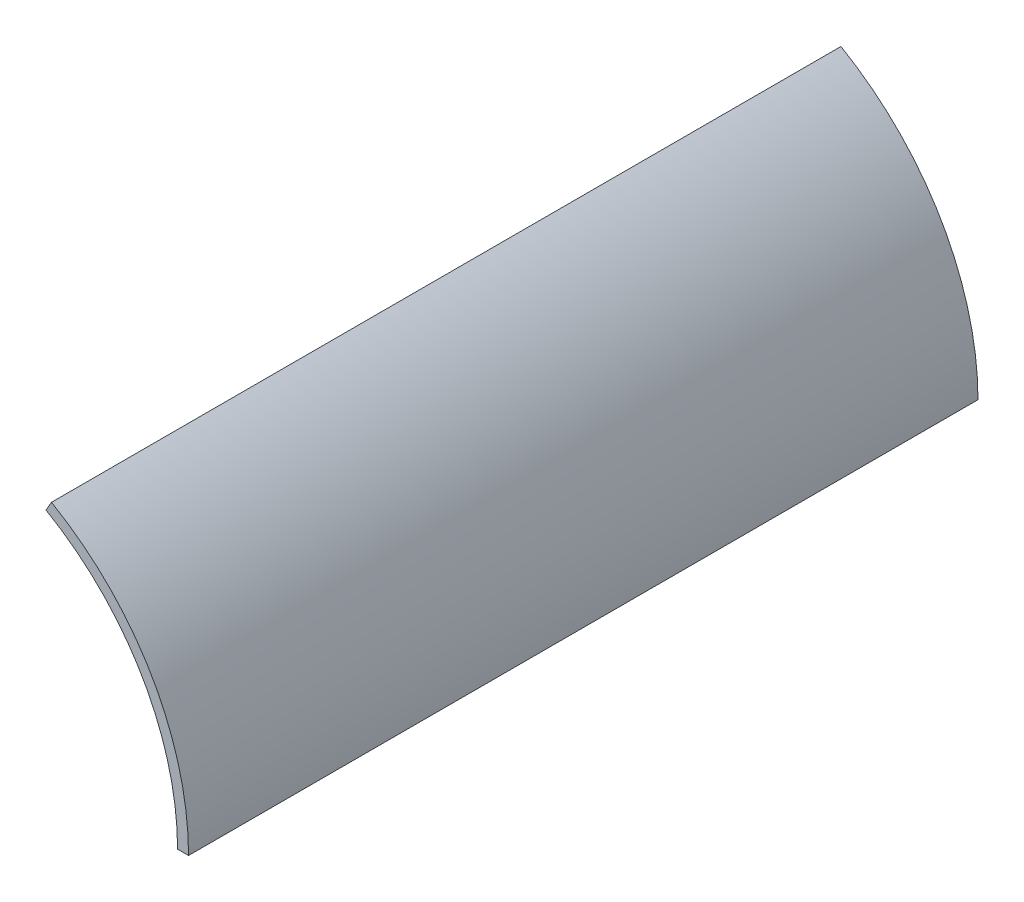
ISO-10303-21;
HEADER;
FILE_DESCRIPTION(('STEP AP214'),'2;1');
FILE_NAME('part.step','',(''),(''),'','','');
FILE_SCHEMA(('AUTOMOTIVE_DESIGN { 1 0 10303 214 1 1 1 1 }'));
ENDSEC;
DATA;
#1=APPLICATION_CONTEXT('core data for automotive mechanical design processes');
#2=APPLICATION_PROTOCOL_DEFINITION('international standard','automotive_design',2000,#1);
#3=PRODUCT_CONTEXT('',#1,'mechanical');
#4=PRODUCT('Part','Part','',(#3));
#5=PRODUCT_RELATED_PRODUCT_CATEGORY('part','',(#4));
#6=PRODUCT_DEFINITION_FORMATION('','',#4);
#7=PRODUCT_DEFINITION_CONTEXT('part definition',#1,'design');
#8=PRODUCT_DEFINITION('design','',#6,#7);
#9=PRODUCT_DEFINITION_SHAPE('','',#8);
#10=(LENGTH_UNIT() NAMED_UNIT(*) SI_UNIT(.MILLI.,.METRE.));
#11=(NAMED_UNIT(*) PLANE_ANGLE_UNIT() SI_UNIT($,.RADIAN.));
#12=(NAMED_UNIT(*) SI_UNIT($,.STERADIAN.) SOLID_ANGLE_UNIT());
#13=UNCERTAINTY_MEASURE_WITH_UNIT(LENGTH_MEASURE(1.E-05),#10,'distance_accuracy_value','');
#14=(GEOMETRIC_REPRESENTATION_CONTEXT(3) GLOBAL_UNCERTAINTY_ASSIGNED_CONTEXT((#13)) GLOBAL_UNIT_ASSIGNED_CONTEXT((#10,
#11,#12)) REPRESENTATION_CONTEXT('',''));
#15=CARTESIAN_POINT('',(0.,0.,0.));
#16=DIRECTION('',(0.,0.,1.));
#17=DIRECTION('',(1.,0.,0.));
#18=AXIS2_PLACEMENT_3D('',#15,#16,#17);
#19=CARTESIAN_POINT('',(0.,0.,120.));
#20=DIRECTION('',(0.,0.,-1.));
#21=DIRECTION('',(-1.,0.,0.));
#22=AXIS2_PLACEMENT_3D('',#19,#20,#21);
#23=CYLINDRICAL_SURFACE('',#22,60.);
#24=CARTESIAN_POINT('',(0.,0.,0.));
#25=DIRECTION('',(0.,0.,-1.));
#26=DIRECTION('',(1.,0.,0.));
#27=AXIS2_PLACEMENT_3D('',#24,#25,#26);
#28=CIRCLE('',#27,60.);
#29=CARTESIAN_POINT('',(29.9999999999999,51.9615242270664,0.));
#30=VERTEX_POINT('',#29);
#31=CARTESIAN_POINT('',(60.,0.,0.));
#32=VERTEX_POINT('',#31);
#33=EDGE_CURVE('E80',#30,#32,#28,.T.);
#34=ORIENTED_EDGE('',*,*,#33,.T.);
#35=DIRECTION('',(0.,0.,-1.));
#36=VECTOR('',#35,1.);
#37=CARTESIAN_POINT('',(60.,0.,120.));
#38=LINE('',#37,#36);
#39=CARTESIAN_POINT('',(60.,0.,180.));
#40=VERTEX_POINT('',#39);
#41=EDGE_CURVE('E11',#40,#32,#38,.T.);
#42=ORIENTED_EDGE('',*,*,#41,.F.);
#43=CARTESIAN_POINT('',(0.,0.,180.));
#44=DIRECTION('',(0.,0.,-1.));
#45=DIRECTION('',(1.,0.,0.));
#46=AXIS2_PLACEMENT_3D('',#43,#44,#45);
#47=CIRCLE('',#46,60.);
#48=CARTESIAN_POINT('',(29.9999999999999,51.9615242270664,180.));
#49=VERTEX_POINT('',#48);
#50=EDGE_CURVE('E78',#49,#40,#47,.T.);
#51=ORIENTED_EDGE('',*,*,#50,.F.);
#52=DIRECTION('',(0.,0.,-1.));
#53=VECTOR('',#52,1.);
#54=CARTESIAN_POINT('',(29.9999999999999,51.9615242270664,120.));
#55=LINE('',#54,#53);
#56=EDGE_CURVE('E103',#49,#30,#55,.T.);
#57=ORIENTED_EDGE('',*,*,#56,.T.);
#58=EDGE_LOOP('',(#34,#42,#51,#57));
#59=FACE_BOUND('',#58,.T.);
#60=ADVANCED_FACE('F35',(#59),#23,.F.);
#61=CARTESIAN_POINT('',(60.,0.,120.));
#62=DIRECTION('',(0.,1.,0.));
#63=DIRECTION('',(0.,0.,1.));
#64=AXIS2_PLACEMENT_3D('',#61,#62,#63);
#65=PLANE('',#64);
#66=DIRECTION('',(1.,0.,0.));
#67=VECTOR('',#66,1.);
#68=CARTESIAN_POINT('',(60.,0.,0.));
#69=LINE('',#68,#67);
#70=CARTESIAN_POINT('',(62.5,0.,0.));
#71=VERTEX_POINT('',#70);
#72=EDGE_CURVE('E99',#32,#71,#69,.T.);
#73=ORIENTED_EDGE('',*,*,#72,.T.);
#74=DIRECTION('',(0.,0.,-1.));
#75=VECTOR('',#74,1.);
#76=CARTESIAN_POINT('',(62.5,0.,120.));
#77=LINE('',#76,#75);
#78=CARTESIAN_POINT('',(62.5,0.,180.));
#79=VERTEX_POINT('',#78);
#80=EDGE_CURVE('E42',#79,#71,#77,.T.);
#81=ORIENTED_EDGE('',*,*,#80,.F.);
#82=DIRECTION('',(1.,0.,0.));
#83=VECTOR('',#82,1.);
#84=CARTESIAN_POINT('',(60.,0.,180.));
#85=LINE('',#84,#83);
#86=EDGE_CURVE('E83',#40,#79,#85,.T.);
#87=ORIENTED_EDGE('',*,*,#86,.F.);
#88=ORIENTED_EDGE('',*,*,#41,.T.);
#89=EDGE_LOOP('',(#73,#81,#87,#88));
#90=FACE_BOUND('',#89,.T.);
#91=ADVANCED_FACE('F84',(#90),#65,.F.);
#92=CARTESIAN_POINT('',(0.,0.,120.));
#93=DIRECTION('',(0.,0.,-1.));
#94=DIRECTION('',(-1.,0.,0.));
#95=AXIS2_PLACEMENT_3D('',#92,#93,#94);
#96=CYLINDRICAL_SURFACE('',#95,62.5);
#97=CARTESIAN_POINT('',(0.,0.,0.));
#98=DIRECTION('',(0.,0.,1.));
#99=DIRECTION('',(1.,0.,0.));
#100=AXIS2_PLACEMENT_3D('',#97,#98,#99);
#101=CIRCLE('',#100,62.5);
#102=CARTESIAN_POINT('',(31.2499999999999,54.1265877365275,0.));
#103=VERTEX_POINT('',#102);
#104=EDGE_CURVE('E57',#71,#103,#101,.T.);
#105=ORIENTED_EDGE('',*,*,#104,.T.);
#106=DIRECTION('',(0.,0.,-1.));
#107=VECTOR('',#106,1.);
#108=CARTESIAN_POINT('',(31.2499999999999,54.1265877365275,120.));
#109=LINE('',#108,#107);
#110=CARTESIAN_POINT('',(31.2499999999999,54.1265877365275,180.));
#111=VERTEX_POINT('',#110);
#112=EDGE_CURVE('E105',#111,#103,#109,.T.);
#113=ORIENTED_EDGE('',*,*,#112,.F.);
#114=CARTESIAN_POINT('',(0.,0.,180.));
#115=DIRECTION('',(0.,0.,1.));
#116=DIRECTION('',(1.,0.,0.));
#117=AXIS2_PLACEMENT_3D('',#114,#115,#116);
#118=CIRCLE('',#117,62.5);
#119=EDGE_CURVE('E88',#79,#111,#118,.T.);
#120=ORIENTED_EDGE('',*,*,#119,.F.);
#121=ORIENTED_EDGE('',*,*,#80,.T.);
#122=EDGE_LOOP('',(#105,#113,#120,#121));
#123=FACE_BOUND('',#122,.T.);
#124=ADVANCED_FACE('F106',(#123),#96,.T.);
#125=CARTESIAN_POINT('',(29.9999999999999,51.9615242270664,120.));
#126=DIRECTION('',(0.86602540378444,-0.499999999999998,0.));
#127=DIRECTION('',(0.499999999999998,0.86602540378444,0.));
#128=AXIS2_PLACEMENT_3D('',#125,#126,#127);
#129=PLANE('',#128);
#130=DIRECTION('',(-0.499999999999998,-0.86602540378444,0.));
#131=VECTOR('',#130,1.);
#132=CARTESIAN_POINT('',(29.9999999999999,51.9615242270664,0.));
#133=LINE('',#132,#131);
#134=EDGE_CURVE('E49',#103,#30,#133,.T.);
#135=ORIENTED_EDGE('',*,*,#134,.T.);
#136=ORIENTED_EDGE('',*,*,#56,.F.);
#137=DIRECTION('',(-0.499999999999998,-0.86602540378444,0.));
#138=VECTOR('',#137,1.);
#139=CARTESIAN_POINT('',(31.2499999999999,54.1265877365275,180.));
#140=LINE('',#139,#138);
#141=EDGE_CURVE('E93',#111,#49,#140,.T.);
#142=ORIENTED_EDGE('',*,*,#141,.F.);
#143=ORIENTED_EDGE('',*,*,#112,.T.);
#144=EDGE_LOOP('',(#135,#136,#142,#143));
#145=FACE_BOUND('',#144,.T.);
#146=ADVANCED_FACE('F110',(#145),#129,.F.);
#147=CARTESIAN_POINT('',(0.,0.,0.));
#148=DIRECTION('',(0.,0.,1.));
#149=DIRECTION('',(1.,0.,0.));
#150=AXIS2_PLACEMENT_3D('',#147,#148,#149);
#151=PLANE('',#150);
#152=ORIENTED_EDGE('',*,*,#33,.F.);
#153=ORIENTED_EDGE('',*,*,#134,.F.);
#154=ORIENTED_EDGE('',*,*,#104,.F.);
#155=ORIENTED_EDGE('',*,*,#72,.F.);
#156=EDGE_LOOP('',(#152,#153,#154,#155));
#157=FACE_BOUND('',#156,.T.);
#158=ADVANCED_FACE('F108',(#157),#151,.F.);
#159=CARTESIAN_POINT('',(0.,0.,180.));
#160=DIRECTION('',(0.,0.,1.));
#161=DIRECTION('',(1.,0.,0.));
#162=AXIS2_PLACEMENT_3D('',#159,#160,#161);
#163=PLANE('',#162);
#164=ORIENTED_EDGE('',*,*,#50,.T.);
#165=ORIENTED_EDGE('',*,*,#86,.T.);
#166=ORIENTED_EDGE('',*,*,#119,.T.);
#167=ORIENTED_EDGE('',*,*,#141,.T.);
#168=EDGE_LOOP('',(#164,#165,#166,#167));
#169=FACE_BOUND('',#168,.T.);
#170=ADVANCED_FACE('F91',(#169),#163,.T.);
#171=CLOSED_SHELL('',(#60,#91,#124,#146,#158,#170));
#172=MANIFOLD_SOLID_BREP('B2',#171);
#173=ADVANCED_BREP_SHAPE_REPRESENTATION('',(#18,#172),#14);
#174=SHAPE_DEFINITION_REPRESENTATION(#9,#173);
ENDSEC;
END-ISO-10303-21;
